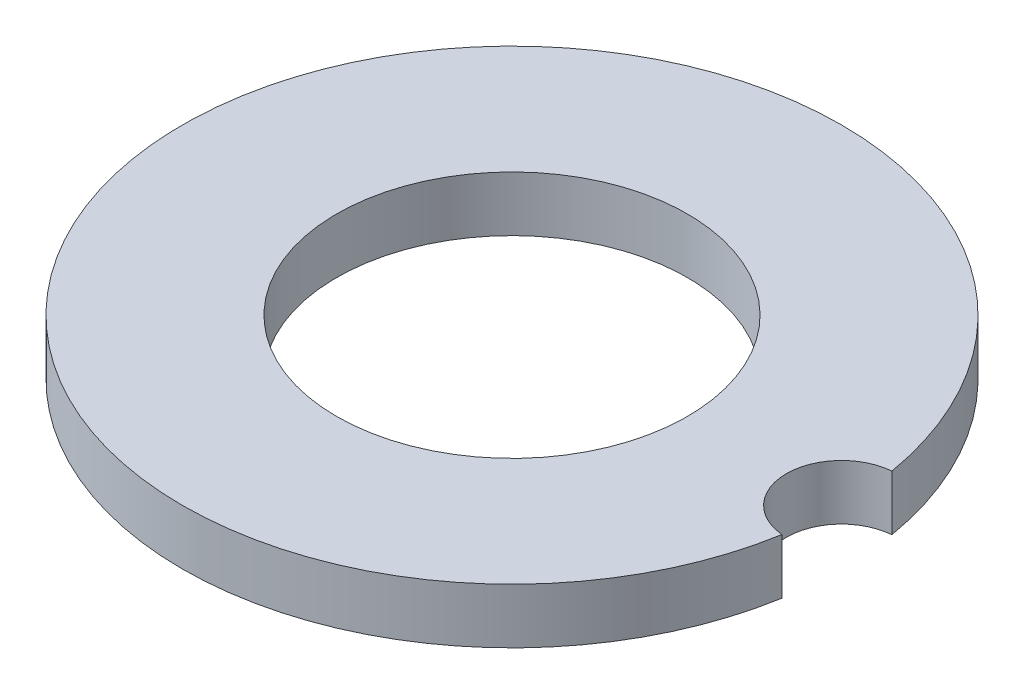
ISO-10303-21;
HEADER;
FILE_DESCRIPTION(('STEP AP214'),'2;1');
FILE_NAME('part.step','',(''),(''),'','','');
FILE_SCHEMA(('AUTOMOTIVE_DESIGN { 1 0 10303 214 1 1 1 1 }'));
ENDSEC;
DATA;
#1=APPLICATION_CONTEXT('core data for automotive mechanical design processes');
#2=APPLICATION_PROTOCOL_DEFINITION('international standard','automotive_design',2000,#1);
#3=PRODUCT_CONTEXT('',#1,'mechanical');
#4=PRODUCT('Part','Part','',(#3));
#5=PRODUCT_RELATED_PRODUCT_CATEGORY('part','',(#4));
#6=PRODUCT_DEFINITION_FORMATION('','',#4);
#7=PRODUCT_DEFINITION_CONTEXT('part definition',#1,'design');
#8=PRODUCT_DEFINITION('design','',#6,#7);
#9=PRODUCT_DEFINITION_SHAPE('','',#8);
#10=(LENGTH_UNIT() NAMED_UNIT(*) SI_UNIT(.MILLI.,.METRE.));
#11=(NAMED_UNIT(*) PLANE_ANGLE_UNIT() SI_UNIT($,.RADIAN.));
#12=(NAMED_UNIT(*) SI_UNIT($,.STERADIAN.) SOLID_ANGLE_UNIT());
#13=UNCERTAINTY_MEASURE_WITH_UNIT(LENGTH_MEASURE(1.E-05),#10,'distance_accuracy_value','');
#14=(GEOMETRIC_REPRESENTATION_CONTEXT(3) GLOBAL_UNCERTAINTY_ASSIGNED_CONTEXT((#13)) GLOBAL_UNIT_ASSIGNED_CONTEXT((#10,
#11,#12)) REPRESENTATION_CONTEXT('',''));
#15=CARTESIAN_POINT('',(0.,0.,0.));
#16=DIRECTION('',(0.,0.,1.));
#17=DIRECTION('',(1.,0.,0.));
#18=AXIS2_PLACEMENT_3D('',#15,#16,#17);
#19=CARTESIAN_POINT('',(0.,12.7,0.));
#20=DIRECTION('',(0.,-1.,0.));
#21=DIRECTION('',(0.,0.,-1.));
#22=AXIS2_PLACEMENT_3D('',#19,#20,#21);
#23=CYLINDRICAL_SURFACE('',#22,75.9206);
#24=CARTESIAN_POINT('',(0.,0.,0.));
#25=DIRECTION('',(0.,1.,0.));
#26=DIRECTION('',(0.,0.,1.));
#27=AXIS2_PLACEMENT_3D('',#24,#25,#26);
#28=CIRCLE('',#27,75.9206);
#29=CARTESIAN_POINT('',(74.8578577116082,0.,-12.6585403261391));
#30=VERTEX_POINT('',#29);
#31=CARTESIAN_POINT('',(74.857857711609,0.,12.6585403261372));
#32=VERTEX_POINT('',#31);
#33=EDGE_CURVE('E91',#30,#32,#28,.T.);
#34=ORIENTED_EDGE('',*,*,#33,.T.);
#35=DIRECTION('',(0.,1.,0.));
#36=VECTOR('',#35,1.);
#37=CARTESIAN_POINT('',(74.857857711609,6.35000000000002,12.6585403261371));
#38=LINE('',#37,#36);
#39=CARTESIAN_POINT('',(74.857857711609,12.7,12.6585403261371));
#40=VERTEX_POINT('',#39);
#41=EDGE_CURVE('E67',#32,#40,#38,.T.);
#42=ORIENTED_EDGE('',*,*,#41,.T.);
#43=CARTESIAN_POINT('',(0.,12.7,0.));
#44=DIRECTION('',(0.,1.,0.));
#45=DIRECTION('',(0.,0.,1.));
#46=AXIS2_PLACEMENT_3D('',#43,#44,#45);
#47=CIRCLE('',#46,75.9206);
#48=CARTESIAN_POINT('',(74.8578577116082,12.7,-12.6585403261391));
#49=VERTEX_POINT('',#48);
#50=EDGE_CURVE('E60',#49,#40,#47,.T.);
#51=ORIENTED_EDGE('',*,*,#50,.F.);
#52=DIRECTION('',(0.,1.,0.));
#53=VECTOR('',#52,1.);
#54=CARTESIAN_POINT('',(74.8578577116082,6.35000000000002,-12.6585403261391));
#55=LINE('',#54,#53);
#56=EDGE_CURVE('E74',#49,#30,#55,.F.);
#57=ORIENTED_EDGE('',*,*,#56,.T.);
#58=EDGE_LOOP('',(#34,#42,#51,#57));
#59=FACE_BOUND('',#58,.T.);
#60=ADVANCED_FACE('F52',(#59),#23,.T.);
#61=CARTESIAN_POINT('',(0.,12.7,0.));
#62=DIRECTION('',(0.,1.,0.));
#63=DIRECTION('',(0.,0.,1.));
#64=AXIS2_PLACEMENT_3D('',#61,#62,#63);
#65=PLANE('',#64);
#66=CARTESIAN_POINT('',(75.9206,12.7,0.));
#67=DIRECTION('',(0.,1.,0.));
#68=DIRECTION('',(0.,0.,1.));
#69=AXIS2_PLACEMENT_3D('',#66,#67,#68);
#70=CIRCLE('',#69,12.7030730282086);
#71=EDGE_CURVE('E77',#49,#40,#70,.T.);
#72=ORIENTED_EDGE('',*,*,#71,.F.);
#73=ORIENTED_EDGE('',*,*,#50,.T.);
#74=EDGE_LOOP('',(#72,#73));
#75=FACE_BOUND('',#74,.T.);
#76=CARTESIAN_POINT('',(0.,12.7,0.));
#77=DIRECTION('',(0.,1.,0.));
#78=DIRECTION('',(0.,0.,1.));
#79=AXIS2_PLACEMENT_3D('',#76,#77,#78);
#80=CIRCLE('',#79,40.4114);
#81=CARTESIAN_POINT('',(0.,12.7,40.4114000000001));
#82=VERTEX_POINT('',#81);
#83=EDGE_CURVE('E95',#82,#82,#80,.T.);
#84=ORIENTED_EDGE('',*,*,#83,.F.);
#85=EDGE_LOOP('',(#84));
#86=FACE_BOUND('',#85,.T.);
#87=ADVANCED_FACE('F86',(#75,#86),#65,.T.);
#88=CARTESIAN_POINT('',(0.,0.,0.));
#89=DIRECTION('',(0.,1.,0.));
#90=DIRECTION('',(0.,0.,1.));
#91=AXIS2_PLACEMENT_3D('',#88,#89,#90);
#92=PLANE('',#91);
#93=CARTESIAN_POINT('',(0.,0.,0.));
#94=DIRECTION('',(0.,1.,0.));
#95=DIRECTION('',(0.,0.,1.));
#96=AXIS2_PLACEMENT_3D('',#93,#94,#95);
#97=CIRCLE('',#96,40.4114);
#98=CARTESIAN_POINT('',(0.,0.,40.4114000000001));
#99=VERTEX_POINT('',#98);
#100=EDGE_CURVE('E97',#99,#99,#97,.T.);
#101=ORIENTED_EDGE('',*,*,#100,.T.);
#102=EDGE_LOOP('',(#101));
#103=FACE_BOUND('',#102,.T.);
#104=ORIENTED_EDGE('',*,*,#33,.F.);
#105=CARTESIAN_POINT('',(75.9206,0.,0.));
#106=DIRECTION('',(0.,1.,0.));
#107=DIRECTION('',(0.,0.,1.));
#108=AXIS2_PLACEMENT_3D('',#105,#106,#107);
#109=CIRCLE('',#108,12.7030730282086);
#110=EDGE_CURVE('E13',#30,#32,#109,.T.);
#111=ORIENTED_EDGE('',*,*,#110,.T.);
#112=EDGE_LOOP('',(#104,#111));
#113=FACE_BOUND('',#112,.T.);
#114=ADVANCED_FACE('F116',(#103,#113),#92,.F.);
#115=CARTESIAN_POINT('',(0.,12.7,0.));
#116=DIRECTION('',(0.,-1.,0.));
#117=DIRECTION('',(0.,0.,-1.));
#118=AXIS2_PLACEMENT_3D('',#115,#116,#117);
#119=CYLINDRICAL_SURFACE('',#118,40.4114);
#120=ORIENTED_EDGE('',*,*,#83,.T.);
#121=EDGE_LOOP('',(#120));
#122=FACE_BOUND('',#121,.T.);
#123=ORIENTED_EDGE('',*,*,#100,.F.);
#124=EDGE_LOOP('',(#123));
#125=FACE_BOUND('',#124,.T.);
#126=ADVANCED_FACE('F113',(#122,#125),#119,.F.);
#127=CARTESIAN_POINT('',(75.9206,0.,0.));
#128=DIRECTION('',(0.,1.,0.));
#129=DIRECTION('',(0.,0.,1.));
#130=AXIS2_PLACEMENT_3D('',#127,#128,#129);
#131=CYLINDRICAL_SURFACE('',#130,12.7030730282086);
#132=ORIENTED_EDGE('',*,*,#110,.F.);
#133=ORIENTED_EDGE('',*,*,#56,.F.);
#134=ORIENTED_EDGE('',*,*,#71,.T.);
#135=ORIENTED_EDGE('',*,*,#41,.F.);
#136=EDGE_LOOP('',(#132,#133,#134,#135));
#137=FACE_BOUND('',#136,.T.);
#138=ADVANCED_FACE('F76',(#137),#131,.F.);
#139=CLOSED_SHELL('',(#60,#87,#114,#126,#138));
#140=MANIFOLD_SOLID_BREP('B2',#139);
#141=ADVANCED_BREP_SHAPE_REPRESENTATION('',(#18,#140),#14);
#142=SHAPE_DEFINITION_REPRESENTATION(#9,#141);
ENDSEC;
END-ISO-10303-21;
